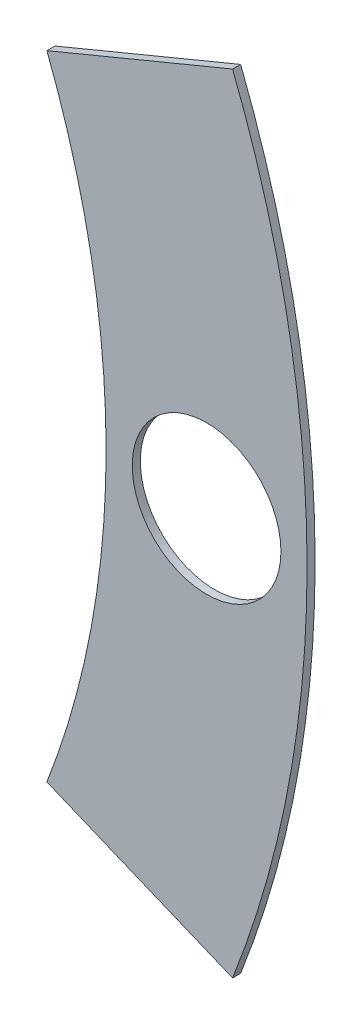
ISO-10303-21;
HEADER;
FILE_DESCRIPTION(('STEP AP214'),'2;1');
FILE_NAME('part.step','',(''),(''),'','','');
FILE_SCHEMA(('AUTOMOTIVE_DESIGN { 1 0 10303 214 1 1 1 1 }'));
ENDSEC;
DATA;
#1=APPLICATION_CONTEXT('core data for automotive mechanical design processes');
#2=APPLICATION_PROTOCOL_DEFINITION('international standard','automotive_design',2000,#1);
#3=PRODUCT_CONTEXT('',#1,'mechanical');
#4=PRODUCT('Part','Part','',(#3));
#5=PRODUCT_RELATED_PRODUCT_CATEGORY('part','',(#4));
#6=PRODUCT_DEFINITION_FORMATION('','',#4);
#7=PRODUCT_DEFINITION_CONTEXT('part definition',#1,'design');
#8=PRODUCT_DEFINITION('design','',#6,#7);
#9=PRODUCT_DEFINITION_SHAPE('','',#8);
#10=(LENGTH_UNIT() NAMED_UNIT(*) SI_UNIT(.MILLI.,.METRE.));
#11=(NAMED_UNIT(*) PLANE_ANGLE_UNIT() SI_UNIT($,.RADIAN.));
#12=(NAMED_UNIT(*) SI_UNIT($,.STERADIAN.) SOLID_ANGLE_UNIT());
#13=UNCERTAINTY_MEASURE_WITH_UNIT(LENGTH_MEASURE(1.E-05),#10,'distance_accuracy_value','');
#14=(GEOMETRIC_REPRESENTATION_CONTEXT(3) GLOBAL_UNCERTAINTY_ASSIGNED_CONTEXT((#13)) GLOBAL_UNIT_ASSIGNED_CONTEXT((#10,
#11,#12)) REPRESENTATION_CONTEXT('',''));
#15=CARTESIAN_POINT('',(0.,0.,0.));
#16=DIRECTION('',(0.,0.,1.));
#17=DIRECTION('',(1.,0.,0.));
#18=AXIS2_PLACEMENT_3D('',#15,#16,#17);
#19=CARTESIAN_POINT('',(0.,0.,0.508));
#20=DIRECTION('',(0.,0.,-1.));
#21=DIRECTION('',(-1.,0.,0.));
#22=AXIS2_PLACEMENT_3D('',#19,#20,#21);
#23=CYLINDRICAL_SURFACE('',#22,68.072);
#24=DIRECTION('',(0.,0.,1.));
#25=VECTOR('',#24,1.);
#26=CARTESIAN_POINT('',(63.3653893290017,-24.8721655507526,0.));
#27=LINE('',#26,#25);
#28=CARTESIAN_POINT('',(63.3653893290017,-24.8721655507526,0.));
#29=VERTEX_POINT('',#28);
#30=CARTESIAN_POINT('',(63.3653893290017,-24.8721655507526,0.508));
#31=VERTEX_POINT('',#30);
#32=EDGE_CURVE('E92',#29,#31,#27,.T.);
#33=ORIENTED_EDGE('',*,*,#32,.F.);
#34=CARTESIAN_POINT('',(0.,0.,0.));
#35=DIRECTION('',(0.,0.,1.));
#36=DIRECTION('',(1.,0.,0.));
#37=AXIS2_PLACEMENT_3D('',#34,#35,#36);
#38=CIRCLE('',#37,68.072);
#39=CARTESIAN_POINT('',(63.3653893290017,24.8721655507526,0.));
#40=VERTEX_POINT('',#39);
#41=EDGE_CURVE('E38',#29,#40,#38,.T.);
#42=ORIENTED_EDGE('',*,*,#41,.T.);
#43=DIRECTION('',(0.,0.,1.));
#44=VECTOR('',#43,1.);
#45=CARTESIAN_POINT('',(63.3653893290017,24.8721655507526,0.));
#46=LINE('',#45,#44);
#47=CARTESIAN_POINT('',(63.3653893290017,24.8721655507526,0.508));
#48=VERTEX_POINT('',#47);
#49=EDGE_CURVE('E73',#40,#48,#46,.T.);
#50=ORIENTED_EDGE('',*,*,#49,.T.);
#51=CARTESIAN_POINT('',(0.,0.,0.508));
#52=DIRECTION('',(0.,0.,1.));
#53=DIRECTION('',(1.,0.,0.));
#54=AXIS2_PLACEMENT_3D('',#51,#52,#53);
#55=CIRCLE('',#54,68.072);
#56=EDGE_CURVE('E12',#31,#48,#55,.T.);
#57=ORIENTED_EDGE('',*,*,#56,.F.);
#58=EDGE_LOOP('',(#33,#42,#50,#57));
#59=FACE_BOUND('',#58,.T.);
#60=ADVANCED_FACE('F35',(#59),#23,.T.);
#61=CARTESIAN_POINT('',(0.,0.,0.508));
#62=DIRECTION('',(0.,0.,1.));
#63=DIRECTION('',(1.,0.,0.));
#64=AXIS2_PLACEMENT_3D('',#61,#62,#63);
#65=PLANE('',#64);
#66=CARTESIAN_POINT('',(61.722,0.,0.508));
#67=DIRECTION('',(0.,0.,1.));
#68=DIRECTION('',(1.,0.,0.));
#69=AXIS2_PLACEMENT_3D('',#66,#67,#68);
#70=CIRCLE('',#69,4.699);
#71=CARTESIAN_POINT('',(66.421,0.,0.508));
#72=VERTEX_POINT('',#71);
#73=EDGE_CURVE('E99',#72,#72,#70,.T.);
#74=ORIENTED_EDGE('',*,*,#73,.F.);
#75=EDGE_LOOP('',(#74));
#76=FACE_BOUND('',#75,.T.);
#77=CARTESIAN_POINT('',(0.,0.,0.508));
#78=DIRECTION('',(0.,0.,1.));
#79=DIRECTION('',(1.,0.,0.));
#80=AXIS2_PLACEMENT_3D('',#77,#78,#79);
#81=CIRCLE('',#80,55.372);
#82=CARTESIAN_POINT('',(51.6296080783409,-20.011045791685,0.508));
#83=VERTEX_POINT('',#82);
#84=CARTESIAN_POINT('',(51.6296080783409,20.011045791685,0.508));
#85=VERTEX_POINT('',#84);
#86=EDGE_CURVE('E93',#83,#85,#81,.T.);
#87=ORIENTED_EDGE('',*,*,#86,.F.);
#88=DIRECTION('',(0.923879532511286,-0.382683432365091,0.));
#89=VECTOR('',#88,1.);
#90=CARTESIAN_POINT('',(51.6296080783409,-20.011045791685,0.508));
#91=LINE('',#90,#89);
#92=EDGE_CURVE('E49',#83,#31,#91,.T.);
#93=ORIENTED_EDGE('',*,*,#92,.T.);
#94=ORIENTED_EDGE('',*,*,#56,.T.);
#95=DIRECTION('',(-0.923879532511286,-0.382683432365091,0.));
#96=VECTOR('',#95,1.);
#97=CARTESIAN_POINT('',(51.6296080783409,20.011045791685,0.508));
#98=LINE('',#97,#96);
#99=EDGE_CURVE('E76',#48,#85,#98,.T.);
#100=ORIENTED_EDGE('',*,*,#99,.T.);
#101=EDGE_LOOP('',(#87,#93,#94,#100));
#102=FACE_BOUND('',#101,.T.);
#103=ADVANCED_FACE('F115',(#76,#102),#65,.T.);
#104=CARTESIAN_POINT('',(0.,0.,0.));
#105=DIRECTION('',(0.,0.,1.));
#106=DIRECTION('',(1.,0.,0.));
#107=AXIS2_PLACEMENT_3D('',#104,#105,#106);
#108=PLANE('',#107);
#109=CARTESIAN_POINT('',(61.722,0.,0.));
#110=DIRECTION('',(0.,0.,1.));
#111=DIRECTION('',(1.,0.,0.));
#112=AXIS2_PLACEMENT_3D('',#109,#110,#111);
#113=CIRCLE('',#112,4.699);
#114=CARTESIAN_POINT('',(66.421,0.,0.));
#115=VERTEX_POINT('',#114);
#116=EDGE_CURVE('E96',#115,#115,#113,.T.);
#117=ORIENTED_EDGE('',*,*,#116,.T.);
#118=EDGE_LOOP('',(#117));
#119=FACE_BOUND('',#118,.T.);
#120=DIRECTION('',(0.923879532511286,-0.382683432365091,0.));
#121=VECTOR('',#120,1.);
#122=CARTESIAN_POINT('',(51.6296080783409,-20.011045791685,0.));
#123=LINE('',#122,#121);
#124=CARTESIAN_POINT('',(51.6296080783409,-20.011045791685,0.));
#125=VERTEX_POINT('',#124);
#126=EDGE_CURVE('E81',#125,#29,#123,.T.);
#127=ORIENTED_EDGE('',*,*,#126,.F.);
#128=CARTESIAN_POINT('',(0.,0.,0.));
#129=DIRECTION('',(0.,0.,1.));
#130=DIRECTION('',(1.,0.,0.));
#131=AXIS2_PLACEMENT_3D('',#128,#129,#130);
#132=CIRCLE('',#131,55.372);
#133=CARTESIAN_POINT('',(51.6296080783409,20.011045791685,0.));
#134=VERTEX_POINT('',#133);
#135=EDGE_CURVE('E89',#125,#134,#132,.T.);
#136=ORIENTED_EDGE('',*,*,#135,.T.);
#137=DIRECTION('',(-0.923879532511286,-0.382683432365091,0.));
#138=VECTOR('',#137,1.);
#139=CARTESIAN_POINT('',(51.6296080783409,20.011045791685,0.));
#140=LINE('',#139,#138);
#141=EDGE_CURVE('E57',#40,#134,#140,.T.);
#142=ORIENTED_EDGE('',*,*,#141,.F.);
#143=ORIENTED_EDGE('',*,*,#41,.F.);
#144=EDGE_LOOP('',(#127,#136,#142,#143));
#145=FACE_BOUND('',#144,.T.);
#146=ADVANCED_FACE('F87',(#119,#145),#108,.F.);
#147=CARTESIAN_POINT('',(0.,0.,0.));
#148=DIRECTION('',(0.,0.,1.));
#149=DIRECTION('',(1.,0.,0.));
#150=AXIS2_PLACEMENT_3D('',#147,#148,#149);
#151=CYLINDRICAL_SURFACE('',#150,55.372);
#152=DIRECTION('',(0.,0.,1.));
#153=VECTOR('',#152,1.);
#154=CARTESIAN_POINT('',(51.6296080783409,-20.011045791685,0.));
#155=LINE('',#154,#153);
#156=EDGE_CURVE('E105',#125,#83,#155,.T.);
#157=ORIENTED_EDGE('',*,*,#156,.T.);
#158=ORIENTED_EDGE('',*,*,#86,.T.);
#159=DIRECTION('',(0.,0.,1.));
#160=VECTOR('',#159,1.);
#161=CARTESIAN_POINT('',(51.6296080783409,20.011045791685,0.));
#162=LINE('',#161,#160);
#163=EDGE_CURVE('E80',#134,#85,#162,.T.);
#164=ORIENTED_EDGE('',*,*,#163,.F.);
#165=ORIENTED_EDGE('',*,*,#135,.F.);
#166=EDGE_LOOP('',(#157,#158,#164,#165));
#167=FACE_BOUND('',#166,.T.);
#168=ADVANCED_FACE('F112',(#167),#151,.F.);
#169=CARTESIAN_POINT('',(61.722,0.,0.));
#170=DIRECTION('',(0.,0.,1.));
#171=DIRECTION('',(1.,0.,0.));
#172=AXIS2_PLACEMENT_3D('',#169,#170,#171);
#173=CYLINDRICAL_SURFACE('',#172,4.699);
#174=ORIENTED_EDGE('',*,*,#116,.F.);
#175=EDGE_LOOP('',(#174));
#176=FACE_BOUND('',#175,.T.);
#177=ORIENTED_EDGE('',*,*,#73,.T.);
#178=EDGE_LOOP('',(#177));
#179=FACE_BOUND('',#178,.T.);
#180=ADVANCED_FACE('F128',(#176,#179),#173,.F.);
#181=CARTESIAN_POINT('',(51.6296080783409,20.011045791685,0.));
#182=DIRECTION('',(-0.382683432365091,0.923879532511286,0.));
#183=DIRECTION('',(-0.923879532511286,-0.382683432365091,0.));
#184=AXIS2_PLACEMENT_3D('',#181,#182,#183);
#185=PLANE('',#184);
#186=ORIENTED_EDGE('',*,*,#99,.F.);
#187=ORIENTED_EDGE('',*,*,#49,.F.);
#188=ORIENTED_EDGE('',*,*,#141,.T.);
#189=ORIENTED_EDGE('',*,*,#163,.T.);
#190=EDGE_LOOP('',(#186,#187,#188,#189));
#191=FACE_BOUND('',#190,.T.);
#192=ADVANCED_FACE('F74',(#191),#185,.T.);
#193=CARTESIAN_POINT('',(51.6296080783409,-20.011045791685,0.));
#194=DIRECTION('',(-0.382683432365091,-0.923879532511286,0.));
#195=DIRECTION('',(0.923879532511286,-0.382683432365091,0.));
#196=AXIS2_PLACEMENT_3D('',#193,#194,#195);
#197=PLANE('',#196);
#198=ORIENTED_EDGE('',*,*,#92,.F.);
#199=ORIENTED_EDGE('',*,*,#156,.F.);
#200=ORIENTED_EDGE('',*,*,#126,.T.);
#201=ORIENTED_EDGE('',*,*,#32,.T.);
#202=EDGE_LOOP('',(#198,#199,#200,#201));
#203=FACE_BOUND('',#202,.T.);
#204=ADVANCED_FACE('F110',(#203),#197,.T.);
#205=CLOSED_SHELL('',(#60,#103,#146,#168,#180,#192,#204));
#206=MANIFOLD_SOLID_BREP('B2',#205);
#207=ADVANCED_BREP_SHAPE_REPRESENTATION('',(#18,#206),#14);
#208=SHAPE_DEFINITION_REPRESENTATION(#9,#207);
ENDSEC;
END-ISO-10303-21;
